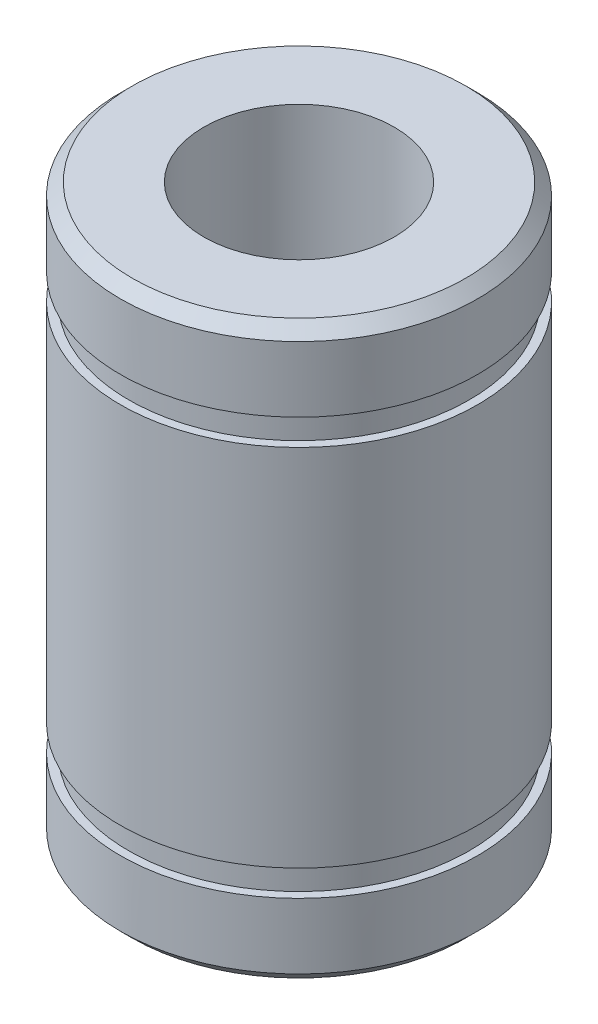
ISO-10303-21;
HEADER;
FILE_DESCRIPTION(('STEP AP214'),'2;1');
FILE_NAME('part.step','',(''),(''),'','','');
FILE_SCHEMA(('AUTOMOTIVE_DESIGN { 1 0 10303 214 1 1 1 1 }'));
ENDSEC;
DATA;
#1=APPLICATION_CONTEXT('core data for automotive mechanical design processes');
#2=APPLICATION_PROTOCOL_DEFINITION('international standard','automotive_design',2000,#1);
#3=PRODUCT_CONTEXT('',#1,'mechanical');
#4=PRODUCT('Part','Part','',(#3));
#5=PRODUCT_RELATED_PRODUCT_CATEGORY('part','',(#4));
#6=PRODUCT_DEFINITION_FORMATION('','',#4);
#7=PRODUCT_DEFINITION_CONTEXT('part definition',#1,'design');
#8=PRODUCT_DEFINITION('design','',#6,#7);
#9=PRODUCT_DEFINITION_SHAPE('','',#8);
#10=(LENGTH_UNIT() NAMED_UNIT(*) SI_UNIT(.MILLI.,.METRE.));
#11=(NAMED_UNIT(*) PLANE_ANGLE_UNIT() SI_UNIT($,.RADIAN.));
#12=(NAMED_UNIT(*) SI_UNIT($,.STERADIAN.) SOLID_ANGLE_UNIT());
#13=UNCERTAINTY_MEASURE_WITH_UNIT(LENGTH_MEASURE(1.E-05),#10,'distance_accuracy_value','');
#14=(GEOMETRIC_REPRESENTATION_CONTEXT(3) GLOBAL_UNCERTAINTY_ASSIGNED_CONTEXT((#13)) GLOBAL_UNIT_ASSIGNED_CONTEXT((#10,
#11,#12)) REPRESENTATION_CONTEXT('',''));
#15=CARTESIAN_POINT('',(0.,0.,0.));
#16=DIRECTION('',(0.,0.,1.));
#17=DIRECTION('',(1.,0.,0.));
#18=AXIS2_PLACEMENT_3D('',#15,#16,#17);
#19=CARTESIAN_POINT('',(0.,0.,0.));
#20=DIRECTION('',(0.,-1.,0.));
#21=DIRECTION('',(0.,0.,-1.));
#22=AXIS2_PLACEMENT_3D('',#19,#20,#21);
#23=CYLINDRICAL_SURFACE('',#22,4.);
#24=CARTESIAN_POINT('',(0.,12.,0.));
#25=DIRECTION('',(0.,-1.,0.));
#26=DIRECTION('',(0.,0.,-1.));
#27=AXIS2_PLACEMENT_3D('',#24,#25,#26);
#28=CIRCLE('',#27,4.);
#29=CARTESIAN_POINT('',(0.,12.,-4.));
#30=VERTEX_POINT('',#29);
#31=EDGE_CURVE('E42',#30,#30,#28,.T.);
#32=ORIENTED_EDGE('',*,*,#31,.F.);
#33=EDGE_LOOP('',(#32));
#34=FACE_BOUND('',#33,.T.);
#35=CARTESIAN_POINT('',(0.,-12.,0.));
#36=DIRECTION('',(0.,-1.,0.));
#37=DIRECTION('',(0.,0.,-1.));
#38=AXIS2_PLACEMENT_3D('',#35,#36,#37);
#39=CIRCLE('',#38,4.);
#40=CARTESIAN_POINT('',(0.,-12.,-4.));
#41=VERTEX_POINT('',#40);
#42=EDGE_CURVE('E66',#41,#41,#39,.T.);
#43=ORIENTED_EDGE('',*,*,#42,.T.);
#44=EDGE_LOOP('',(#43));
#45=FACE_BOUND('',#44,.T.);
#46=ADVANCED_FACE('F31',(#34,#45),#23,.F.);
#47=CARTESIAN_POINT('',(4.,12.,0.));
#48=DIRECTION('',(0.,1.,0.));
#49=DIRECTION('',(0.,0.,1.));
#50=AXIS2_PLACEMENT_3D('',#47,#48,#49);
#51=PLANE('',#50);
#52=CARTESIAN_POINT('',(0.,12.,0.));
#53=DIRECTION('',(0.,1.,0.));
#54=DIRECTION('',(0.,0.,1.));
#55=AXIS2_PLACEMENT_3D('',#52,#53,#54);
#56=CIRCLE('',#55,7.);
#57=CARTESIAN_POINT('',(0.,12.,7.));
#58=VERTEX_POINT('',#57);
#59=EDGE_CURVE('E10',#58,#58,#56,.T.);
#60=ORIENTED_EDGE('',*,*,#59,.T.);
#61=EDGE_LOOP('',(#60));
#62=FACE_BOUND('',#61,.T.);
#63=ORIENTED_EDGE('',*,*,#31,.T.);
#64=EDGE_LOOP('',(#63));
#65=FACE_BOUND('',#64,.T.);
#66=ADVANCED_FACE('F100',(#62,#65),#51,.T.);
#67=CARTESIAN_POINT('',(0.,0.,0.));
#68=DIRECTION('',(0.,-1.,0.));
#69=DIRECTION('',(0.,0.,-1.));
#70=AXIS2_PLACEMENT_3D('',#67,#68,#69);
#71=CYLINDRICAL_SURFACE('',#70,7.5);
#72=CARTESIAN_POINT('',(0.,11.5,0.));
#73=DIRECTION('',(0.,1.,0.));
#74=DIRECTION('',(0.,0.,1.));
#75=AXIS2_PLACEMENT_3D('',#72,#73,#74);
#76=CIRCLE('',#75,7.5);
#77=CARTESIAN_POINT('',(0.,11.5,7.5));
#78=VERTEX_POINT('',#77);
#79=EDGE_CURVE('E38',#78,#78,#76,.F.);
#80=ORIENTED_EDGE('',*,*,#79,.T.);
#81=EDGE_LOOP('',(#80));
#82=FACE_BOUND('',#81,.T.);
#83=CARTESIAN_POINT('',(0.,8.75,0.));
#84=DIRECTION('',(0.,-1.,0.));
#85=DIRECTION('',(0.,0.,-1.));
#86=AXIS2_PLACEMENT_3D('',#83,#84,#85);
#87=CIRCLE('',#86,7.5);
#88=CARTESIAN_POINT('',(0.,8.75,-7.5));
#89=VERTEX_POINT('',#88);
#90=EDGE_CURVE('E46',#89,#89,#87,.T.);
#91=ORIENTED_EDGE('',*,*,#90,.F.);
#92=EDGE_LOOP('',(#91));
#93=FACE_BOUND('',#92,.T.);
#94=ADVANCED_FACE('F105',(#82,#93),#71,.T.);
#95=CARTESIAN_POINT('',(7.5,8.75,0.));
#96=DIRECTION('',(0.,-1.,0.));
#97=DIRECTION('',(0.,0.,-1.));
#98=AXIS2_PLACEMENT_3D('',#95,#96,#97);
#99=PLANE('',#98);
#100=ORIENTED_EDGE('',*,*,#90,.T.);
#101=EDGE_LOOP('',(#100));
#102=FACE_BOUND('',#101,.T.);
#103=CARTESIAN_POINT('',(0.,8.75,0.));
#104=DIRECTION('',(0.,-1.,0.));
#105=DIRECTION('',(0.,0.,-1.));
#106=AXIS2_PLACEMENT_3D('',#103,#104,#105);
#107=CIRCLE('',#106,7.15);
#108=CARTESIAN_POINT('',(0.,8.75,-7.15));
#109=VERTEX_POINT('',#108);
#110=EDGE_CURVE('E51',#109,#109,#107,.T.);
#111=ORIENTED_EDGE('',*,*,#110,.F.);
#112=EDGE_LOOP('',(#111));
#113=FACE_BOUND('',#112,.T.);
#114=ADVANCED_FACE('F112',(#102,#113),#99,.T.);
#115=CARTESIAN_POINT('',(0.,0.,0.));
#116=DIRECTION('',(0.,-1.,0.));
#117=DIRECTION('',(0.,0.,-1.));
#118=AXIS2_PLACEMENT_3D('',#115,#116,#117);
#119=CYLINDRICAL_SURFACE('',#118,7.15);
#120=ORIENTED_EDGE('',*,*,#110,.T.);
#121=EDGE_LOOP('',(#120));
#122=FACE_BOUND('',#121,.T.);
#123=CARTESIAN_POINT('',(0.,7.65,0.));
#124=DIRECTION('',(0.,-1.,0.));
#125=DIRECTION('',(0.,0.,-1.));
#126=AXIS2_PLACEMENT_3D('',#123,#124,#125);
#127=CIRCLE('',#126,7.15);
#128=CARTESIAN_POINT('',(0.,7.65,-7.15));
#129=VERTEX_POINT('',#128);
#130=EDGE_CURVE('E54',#129,#129,#127,.T.);
#131=ORIENTED_EDGE('',*,*,#130,.F.);
#132=EDGE_LOOP('',(#131));
#133=FACE_BOUND('',#132,.T.);
#134=ADVANCED_FACE('F95',(#122,#133),#119,.T.);
#135=CARTESIAN_POINT('',(7.15,7.65,0.));
#136=DIRECTION('',(0.,1.,0.));
#137=DIRECTION('',(0.,0.,1.));
#138=AXIS2_PLACEMENT_3D('',#135,#136,#137);
#139=PLANE('',#138);
#140=ORIENTED_EDGE('',*,*,#130,.T.);
#141=EDGE_LOOP('',(#140));
#142=FACE_BOUND('',#141,.T.);
#143=CARTESIAN_POINT('',(0.,7.65,0.));
#144=DIRECTION('',(0.,-1.,0.));
#145=DIRECTION('',(0.,0.,-1.));
#146=AXIS2_PLACEMENT_3D('',#143,#144,#145);
#147=CIRCLE('',#146,7.5);
#148=CARTESIAN_POINT('',(0.,7.65,-7.5));
#149=VERTEX_POINT('',#148);
#150=EDGE_CURVE('E57',#149,#149,#147,.T.);
#151=ORIENTED_EDGE('',*,*,#150,.F.);
#152=EDGE_LOOP('',(#151));
#153=FACE_BOUND('',#152,.T.);
#154=ADVANCED_FACE('F86',(#142,#153),#139,.T.);
#155=CARTESIAN_POINT('',(0.,0.,0.));
#156=DIRECTION('',(0.,-1.,0.));
#157=DIRECTION('',(0.,0.,-1.));
#158=AXIS2_PLACEMENT_3D('',#155,#156,#157);
#159=CYLINDRICAL_SURFACE('',#158,7.5);
#160=ORIENTED_EDGE('',*,*,#150,.T.);
#161=EDGE_LOOP('',(#160));
#162=FACE_BOUND('',#161,.T.);
#163=CARTESIAN_POINT('',(0.,-7.65,0.));
#164=DIRECTION('',(0.,-1.,0.));
#165=DIRECTION('',(0.,0.,-1.));
#166=AXIS2_PLACEMENT_3D('',#163,#164,#165);
#167=CIRCLE('',#166,7.5);
#168=CARTESIAN_POINT('',(0.,-7.65,-7.5));
#169=VERTEX_POINT('',#168);
#170=EDGE_CURVE('E78',#169,#169,#167,.T.);
#171=ORIENTED_EDGE('',*,*,#170,.F.);
#172=EDGE_LOOP('',(#171));
#173=FACE_BOUND('',#172,.T.);
#174=ADVANCED_FACE('F84',(#162,#173),#159,.T.);
#175=CARTESIAN_POINT('',(0.,11.5,0.));
#176=DIRECTION('',(0.,-1.,0.));
#177=DIRECTION('',(0.,0.,-1.));
#178=AXIS2_PLACEMENT_3D('',#175,#176,#177);
#179=CONICAL_SURFACE('',#178,7.5,0.785398163397449);
#180=ORIENTED_EDGE('',*,*,#59,.F.);
#181=EDGE_LOOP('',(#180));
#182=FACE_BOUND('',#181,.T.);
#183=ORIENTED_EDGE('',*,*,#79,.F.);
#184=EDGE_LOOP('',(#183));
#185=FACE_BOUND('',#184,.T.);
#186=ADVANCED_FACE('F33',(#182,#185),#179,.T.);
#187=CARTESIAN_POINT('',(4.,-12.,0.));
#188=DIRECTION('',(0.,-1.,0.));
#189=DIRECTION('',(0.,0.,1.));
#190=AXIS2_PLACEMENT_3D('',#187,#188,#189);
#191=PLANE('',#190);
#192=CARTESIAN_POINT('',(0.,-12.,0.));
#193=DIRECTION('',(0.,1.,0.));
#194=DIRECTION('',(0.,0.,1.));
#195=AXIS2_PLACEMENT_3D('',#192,#193,#194);
#196=CIRCLE('',#195,7.);
#197=CARTESIAN_POINT('',(0.,-12.,7.));
#198=VERTEX_POINT('',#197);
#199=EDGE_CURVE('E60',#198,#198,#196,.T.);
#200=ORIENTED_EDGE('',*,*,#199,.F.);
#201=EDGE_LOOP('',(#200));
#202=FACE_BOUND('',#201,.T.);
#203=ORIENTED_EDGE('',*,*,#42,.F.);
#204=EDGE_LOOP('',(#203));
#205=FACE_BOUND('',#204,.T.);
#206=ADVANCED_FACE('F93',(#202,#205),#191,.T.);
#207=CARTESIAN_POINT('',(0.,0.,0.));
#208=DIRECTION('',(0.,1.,0.));
#209=DIRECTION('',(0.,0.,-1.));
#210=AXIS2_PLACEMENT_3D('',#207,#208,#209);
#211=CYLINDRICAL_SURFACE('',#210,7.5);
#212=CARTESIAN_POINT('',(0.,-11.5,0.));
#213=DIRECTION('',(0.,1.,0.));
#214=DIRECTION('',(0.,0.,1.));
#215=AXIS2_PLACEMENT_3D('',#212,#213,#214);
#216=CIRCLE('',#215,7.5);
#217=CARTESIAN_POINT('',(0.,-11.5,7.5));
#218=VERTEX_POINT('',#217);
#219=EDGE_CURVE('E63',#218,#218,#216,.F.);
#220=ORIENTED_EDGE('',*,*,#219,.F.);
#221=EDGE_LOOP('',(#220));
#222=FACE_BOUND('',#221,.T.);
#223=CARTESIAN_POINT('',(0.,-8.75,0.));
#224=DIRECTION('',(0.,-1.,0.));
#225=DIRECTION('',(0.,0.,-1.));
#226=AXIS2_PLACEMENT_3D('',#223,#224,#225);
#227=CIRCLE('',#226,7.5);
#228=CARTESIAN_POINT('',(0.,-8.75,-7.5));
#229=VERTEX_POINT('',#228);
#230=EDGE_CURVE('E69',#229,#229,#227,.T.);
#231=ORIENTED_EDGE('',*,*,#230,.T.);
#232=EDGE_LOOP('',(#231));
#233=FACE_BOUND('',#232,.T.);
#234=ADVANCED_FACE('F175',(#222,#233),#211,.T.);
#235=CARTESIAN_POINT('',(7.5,-8.75,0.));
#236=DIRECTION('',(0.,1.,0.));
#237=DIRECTION('',(0.,0.,-1.));
#238=AXIS2_PLACEMENT_3D('',#235,#236,#237);
#239=PLANE('',#238);
#240=ORIENTED_EDGE('',*,*,#230,.F.);
#241=EDGE_LOOP('',(#240));
#242=FACE_BOUND('',#241,.T.);
#243=CARTESIAN_POINT('',(0.,-8.75,0.));
#244=DIRECTION('',(0.,-1.,0.));
#245=DIRECTION('',(0.,0.,-1.));
#246=AXIS2_PLACEMENT_3D('',#243,#244,#245);
#247=CIRCLE('',#246,7.15);
#248=CARTESIAN_POINT('',(0.,-8.75,-7.15));
#249=VERTEX_POINT('',#248);
#250=EDGE_CURVE('E72',#249,#249,#247,.T.);
#251=ORIENTED_EDGE('',*,*,#250,.T.);
#252=EDGE_LOOP('',(#251));
#253=FACE_BOUND('',#252,.T.);
#254=ADVANCED_FACE('F185',(#242,#253),#239,.T.);
#255=CARTESIAN_POINT('',(0.,0.,0.));
#256=DIRECTION('',(0.,1.,0.));
#257=DIRECTION('',(0.,0.,-1.));
#258=AXIS2_PLACEMENT_3D('',#255,#256,#257);
#259=CYLINDRICAL_SURFACE('',#258,7.15);
#260=ORIENTED_EDGE('',*,*,#250,.F.);
#261=EDGE_LOOP('',(#260));
#262=FACE_BOUND('',#261,.T.);
#263=CARTESIAN_POINT('',(0.,-7.65,0.));
#264=DIRECTION('',(0.,-1.,0.));
#265=DIRECTION('',(0.,0.,-1.));
#266=AXIS2_PLACEMENT_3D('',#263,#264,#265);
#267=CIRCLE('',#266,7.15);
#268=CARTESIAN_POINT('',(0.,-7.65,-7.15));
#269=VERTEX_POINT('',#268);
#270=EDGE_CURVE('E75',#269,#269,#267,.T.);
#271=ORIENTED_EDGE('',*,*,#270,.T.);
#272=EDGE_LOOP('',(#271));
#273=FACE_BOUND('',#272,.T.);
#274=ADVANCED_FACE('F195',(#262,#273),#259,.T.);
#275=CARTESIAN_POINT('',(7.15,-7.65,0.));
#276=DIRECTION('',(0.,-1.,0.));
#277=DIRECTION('',(0.,0.,1.));
#278=AXIS2_PLACEMENT_3D('',#275,#276,#277);
#279=PLANE('',#278);
#280=ORIENTED_EDGE('',*,*,#270,.F.);
#281=EDGE_LOOP('',(#280));
#282=FACE_BOUND('',#281,.T.);
#283=ORIENTED_EDGE('',*,*,#170,.T.);
#284=EDGE_LOOP('',(#283));
#285=FACE_BOUND('',#284,.T.);
#286=ADVANCED_FACE('F82',(#282,#285),#279,.T.);
#287=CARTESIAN_POINT('',(0.,-11.5,0.));
#288=DIRECTION('',(0.,1.,0.));
#289=DIRECTION('',(0.,0.,-1.));
#290=AXIS2_PLACEMENT_3D('',#287,#288,#289);
#291=CONICAL_SURFACE('',#290,7.5,0.785398163397449);
#292=ORIENTED_EDGE('',*,*,#199,.T.);
#293=EDGE_LOOP('',(#292));
#294=FACE_BOUND('',#293,.T.);
#295=ORIENTED_EDGE('',*,*,#219,.T.);
#296=EDGE_LOOP('',(#295));
#297=FACE_BOUND('',#296,.T.);
#298=ADVANCED_FACE('F214',(#294,#297),#291,.T.);
#299=CLOSED_SHELL('',(#46,#66,#94,#114,#134,#154,#174,#186,#206,#234,#254,#274,#286,#298));
#300=MANIFOLD_SOLID_BREP('B2',#299);
#301=ADVANCED_BREP_SHAPE_REPRESENTATION('',(#18,#300),#14);
#302=SHAPE_DEFINITION_REPRESENTATION(#9,#301);
ENDSEC;
END-ISO-10303-21;
